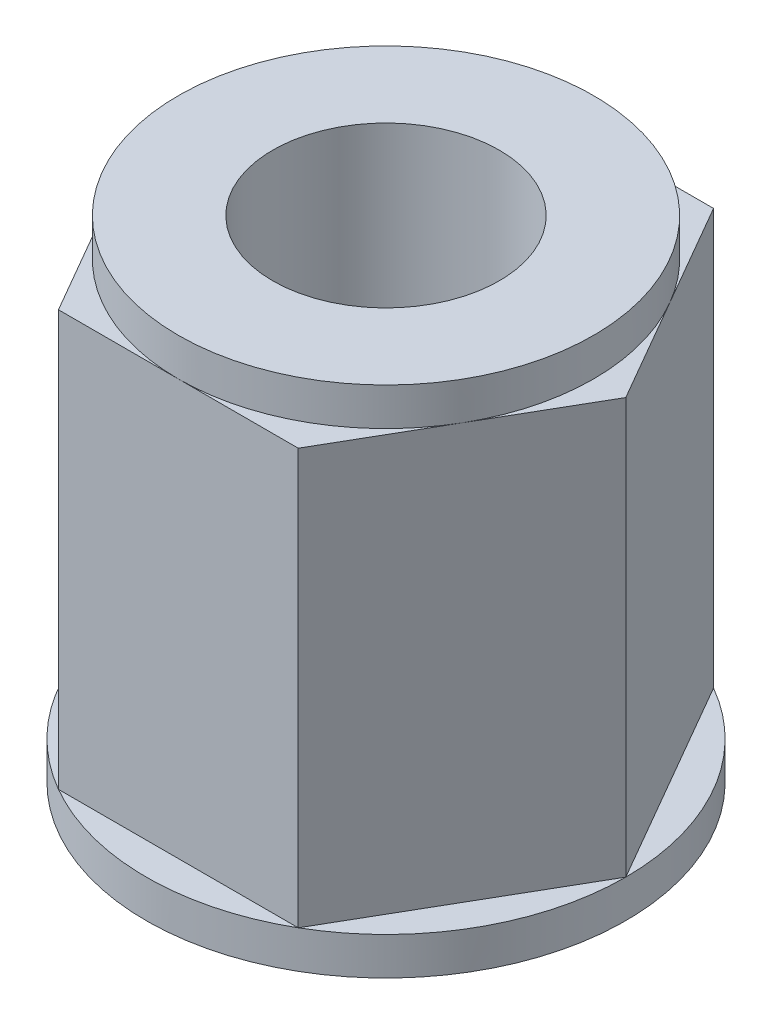
ISO-10303-21;
HEADER;
FILE_DESCRIPTION(('STEP AP214'),'2;1');
FILE_NAME('part.step','',(''),(''),'','','');
FILE_SCHEMA(('AUTOMOTIVE_DESIGN { 1 0 10303 214 1 1 1 1 }'));
ENDSEC;
DATA;
#1=APPLICATION_CONTEXT('core data for automotive mechanical design processes');
#2=APPLICATION_PROTOCOL_DEFINITION('international standard','automotive_design',2000,#1);
#3=PRODUCT_CONTEXT('',#1,'mechanical');
#4=PRODUCT('Part','Part','',(#3));
#5=PRODUCT_RELATED_PRODUCT_CATEGORY('part','',(#4));
#6=PRODUCT_DEFINITION_FORMATION('','',#4);
#7=PRODUCT_DEFINITION_CONTEXT('part definition',#1,'design');
#8=PRODUCT_DEFINITION('design','',#6,#7);
#9=PRODUCT_DEFINITION_SHAPE('','',#8);
#10=(LENGTH_UNIT() NAMED_UNIT(*) SI_UNIT(.MILLI.,.METRE.));
#11=(NAMED_UNIT(*) PLANE_ANGLE_UNIT() SI_UNIT($,.RADIAN.));
#12=(NAMED_UNIT(*) SI_UNIT($,.STERADIAN.) SOLID_ANGLE_UNIT());
#13=UNCERTAINTY_MEASURE_WITH_UNIT(LENGTH_MEASURE(1.E-05),#10,'distance_accuracy_value','');
#14=(GEOMETRIC_REPRESENTATION_CONTEXT(3) GLOBAL_UNCERTAINTY_ASSIGNED_CONTEXT((#13)) GLOBAL_UNIT_ASSIGNED_CONTEXT((#10,
#11,#12)) REPRESENTATION_CONTEXT('',''));
#15=CARTESIAN_POINT('',(0.,0.,0.));
#16=DIRECTION('',(0.,0.,1.));
#17=DIRECTION('',(1.,0.,0.));
#18=AXIS2_PLACEMENT_3D('',#15,#16,#17);
#19=CARTESIAN_POINT('',(0.,11.,0.));
#20=DIRECTION('',(0.,1.,0.));
#21=DIRECTION('',(0.,0.,1.));
#22=AXIS2_PLACEMENT_3D('',#19,#20,#21);
#23=PLANE('',#22);
#24=CARTESIAN_POINT('',(0.,11.,0.));
#25=DIRECTION('',(0.,1.,0.));
#26=DIRECTION('',(0.,0.,1.));
#27=AXIS2_PLACEMENT_3D('',#24,#25,#26);
#28=CIRCLE('',#27,5.49926131403119);
#29=CARTESIAN_POINT('',(0.,11.,5.49926131403119));
#30=VERTEX_POINT('',#29);
#31=CARTESIAN_POINT('',(4.7625,11.,2.74963065701559));
#32=VERTEX_POINT('',#31);
#33=EDGE_CURVE('E43',#30,#32,#28,.T.);
#34=ORIENTED_EDGE('',*,*,#33,.F.);
#35=DIRECTION('',(1.,0.,0.));
#36=VECTOR('',#35,1.);
#37=CARTESIAN_POINT('',(-3.175,11.,5.49926131403119));
#38=LINE('',#37,#36);
#39=CARTESIAN_POINT('',(3.175,11.,5.49926131403119));
#40=VERTEX_POINT('',#39);
#41=EDGE_CURVE('E115',#30,#40,#38,.T.);
#42=ORIENTED_EDGE('',*,*,#41,.T.);
#43=DIRECTION('',(0.5,0.,-0.866025403784439));
#44=VECTOR('',#43,1.);
#45=CARTESIAN_POINT('',(3.175,11.,5.49926131403119));
#46=LINE('',#45,#44);
#47=EDGE_CURVE('E128',#40,#32,#46,.T.);
#48=ORIENTED_EDGE('',*,*,#47,.T.);
#49=EDGE_LOOP('',(#34,#42,#48));
#50=FACE_BOUND('',#49,.T.);
#51=ADVANCED_FACE('F32',(#50),#23,.T.);
#52=CARTESIAN_POINT('',(4.7625,11.,-2.74963065701559));
#53=VERTEX_POINT('',#52);
#54=EDGE_CURVE('E11',#32,#53,#28,.T.);
#55=ORIENTED_EDGE('',*,*,#54,.F.);
#56=CARTESIAN_POINT('',(6.35,11.,0.));
#57=VERTEX_POINT('',#56);
#58=EDGE_CURVE('E114',#32,#57,#46,.T.);
#59=ORIENTED_EDGE('',*,*,#58,.T.);
#60=DIRECTION('',(-0.5,0.,-0.866025403784439));
#61=VECTOR('',#60,1.);
#62=CARTESIAN_POINT('',(6.35,11.,0.));
#63=LINE('',#62,#61);
#64=EDGE_CURVE('E157',#57,#53,#63,.T.);
#65=ORIENTED_EDGE('',*,*,#64,.T.);
#66=EDGE_LOOP('',(#55,#59,#65));
#67=FACE_BOUND('',#66,.T.);
#68=ADVANCED_FACE('F211',(#67),#23,.T.);
#69=CARTESIAN_POINT('',(0.,11.,-5.49926131403118));
#70=VERTEX_POINT('',#69);
#71=EDGE_CURVE('E41',#53,#70,#28,.T.);
#72=ORIENTED_EDGE('',*,*,#71,.F.);
#73=CARTESIAN_POINT('',(3.175,11.,-5.49926131403118));
#74=VERTEX_POINT('',#73);
#75=EDGE_CURVE('E180',#53,#74,#63,.T.);
#76=ORIENTED_EDGE('',*,*,#75,.T.);
#77=DIRECTION('',(-1.,0.,0.));
#78=VECTOR('',#77,1.);
#79=CARTESIAN_POINT('',(3.175,11.,-5.49926131403118));
#80=LINE('',#79,#78);
#81=EDGE_CURVE('E171',#74,#70,#80,.T.);
#82=ORIENTED_EDGE('',*,*,#81,.T.);
#83=EDGE_LOOP('',(#72,#76,#82));
#84=FACE_BOUND('',#83,.T.);
#85=ADVANCED_FACE('F204',(#84),#23,.T.);
#86=CARTESIAN_POINT('',(-4.7625,11.,-2.74963065701559));
#87=VERTEX_POINT('',#86);
#88=EDGE_CURVE('E137',#70,#87,#28,.T.);
#89=ORIENTED_EDGE('',*,*,#88,.F.);
#90=CARTESIAN_POINT('',(-3.175,11.,-5.49926131403118));
#91=VERTEX_POINT('',#90);
#92=EDGE_CURVE('E147',#70,#91,#80,.T.);
#93=ORIENTED_EDGE('',*,*,#92,.T.);
#94=DIRECTION('',(-0.5,0.,0.866025403784439));
#95=VECTOR('',#94,1.);
#96=CARTESIAN_POINT('',(-3.175,11.,-5.49926131403118));
#97=LINE('',#96,#95);
#98=EDGE_CURVE('E174',#91,#87,#97,.T.);
#99=ORIENTED_EDGE('',*,*,#98,.T.);
#100=EDGE_LOOP('',(#89,#93,#99));
#101=FACE_BOUND('',#100,.T.);
#102=ADVANCED_FACE('F201',(#101),#23,.T.);
#103=CARTESIAN_POINT('',(-4.7625,11.,2.74963065701559));
#104=VERTEX_POINT('',#103);
#105=EDGE_CURVE('E135',#87,#104,#28,.T.);
#106=ORIENTED_EDGE('',*,*,#105,.F.);
#107=CARTESIAN_POINT('',(-6.35,11.,0.));
#108=VERTEX_POINT('',#107);
#109=EDGE_CURVE('E173',#87,#108,#97,.T.);
#110=ORIENTED_EDGE('',*,*,#109,.T.);
#111=DIRECTION('',(0.5,0.,0.866025403784439));
#112=VECTOR('',#111,1.);
#113=CARTESIAN_POINT('',(-6.35,11.,0.));
#114=LINE('',#113,#112);
#115=EDGE_CURVE('E126',#108,#104,#114,.T.);
#116=ORIENTED_EDGE('',*,*,#115,.T.);
#117=EDGE_LOOP('',(#106,#110,#116));
#118=FACE_BOUND('',#117,.T.);
#119=ADVANCED_FACE('F203',(#118),#23,.T.);
#120=CARTESIAN_POINT('',(3.175,0.,-5.49926131403118));
#121=DIRECTION('',(0.,0.,-1.));
#122=DIRECTION('',(-1.,0.,0.));
#123=AXIS2_PLACEMENT_3D('',#120,#121,#122);
#124=PLANE('',#123);
#125=ORIENTED_EDGE('',*,*,#81,.F.);
#126=DIRECTION('',(0.,1.,0.));
#127=VECTOR('',#126,1.);
#128=CARTESIAN_POINT('',(3.175,0.,-5.49926131403118));
#129=LINE('',#128,#127);
#130=CARTESIAN_POINT('',(3.175,0.,-5.49926131403118));
#131=VERTEX_POINT('',#130);
#132=EDGE_CURVE('E136',#131,#74,#129,.T.);
#133=ORIENTED_EDGE('',*,*,#132,.F.);
#134=DIRECTION('',(-1.,0.,0.));
#135=VECTOR('',#134,1.);
#136=CARTESIAN_POINT('',(3.175,0.,-5.49926131403118));
#137=LINE('',#136,#135);
#138=CARTESIAN_POINT('',(-3.175,0.,-5.49926131403118));
#139=VERTEX_POINT('',#138);
#140=EDGE_CURVE('E153',#131,#139,#137,.T.);
#141=ORIENTED_EDGE('',*,*,#140,.T.);
#142=DIRECTION('',(0.,1.,0.));
#143=VECTOR('',#142,1.);
#144=CARTESIAN_POINT('',(-3.175,0.,-5.49926131403118));
#145=LINE('',#144,#143);
#146=EDGE_CURVE('E36',#139,#91,#145,.T.);
#147=ORIENTED_EDGE('',*,*,#146,.T.);
#148=ORIENTED_EDGE('',*,*,#92,.F.);
#149=EDGE_LOOP('',(#125,#133,#141,#147,#148));
#150=FACE_BOUND('',#149,.T.);
#151=ADVANCED_FACE('F34',(#150),#124,.T.);
#152=CARTESIAN_POINT('',(6.35,0.,0.));
#153=DIRECTION('',(0.866025403784439,0.,-0.5));
#154=DIRECTION('',(-0.5,0.,-0.866025403784439));
#155=AXIS2_PLACEMENT_3D('',#152,#153,#154);
#156=PLANE('',#155);
#157=ORIENTED_EDGE('',*,*,#64,.F.);
#158=DIRECTION('',(0.,1.,0.));
#159=VECTOR('',#158,1.);
#160=CARTESIAN_POINT('',(6.35,0.,0.));
#161=LINE('',#160,#159);
#162=CARTESIAN_POINT('',(6.35,0.,0.));
#163=VERTEX_POINT('',#162);
#164=EDGE_CURVE('E139',#163,#57,#161,.T.);
#165=ORIENTED_EDGE('',*,*,#164,.F.);
#166=DIRECTION('',(-0.5,0.,-0.866025403784439));
#167=VECTOR('',#166,1.);
#168=CARTESIAN_POINT('',(6.35,0.,0.));
#169=LINE('',#168,#167);
#170=EDGE_CURVE('E168',#163,#131,#169,.T.);
#171=ORIENTED_EDGE('',*,*,#170,.T.);
#172=ORIENTED_EDGE('',*,*,#132,.T.);
#173=ORIENTED_EDGE('',*,*,#75,.F.);
#174=EDGE_LOOP('',(#157,#165,#171,#172,#173));
#175=FACE_BOUND('',#174,.T.);
#176=ADVANCED_FACE('F239',(#175),#156,.T.);
#177=CARTESIAN_POINT('',(3.175,0.,5.49926131403119));
#178=DIRECTION('',(0.866025403784439,0.,0.5));
#179=DIRECTION('',(0.5,0.,-0.866025403784439));
#180=AXIS2_PLACEMENT_3D('',#177,#178,#179);
#181=PLANE('',#180);
#182=ORIENTED_EDGE('',*,*,#47,.F.);
#183=DIRECTION('',(0.,1.,0.));
#184=VECTOR('',#183,1.);
#185=CARTESIAN_POINT('',(3.175,0.,5.49926131403119));
#186=LINE('',#185,#184);
#187=CARTESIAN_POINT('',(3.175,0.,5.49926131403119));
#188=VERTEX_POINT('',#187);
#189=EDGE_CURVE('E122',#188,#40,#186,.T.);
#190=ORIENTED_EDGE('',*,*,#189,.F.);
#191=DIRECTION('',(0.5,0.,-0.866025403784439));
#192=VECTOR('',#191,1.);
#193=CARTESIAN_POINT('',(3.175,0.,5.49926131403119));
#194=LINE('',#193,#192);
#195=EDGE_CURVE('E165',#188,#163,#194,.T.);
#196=ORIENTED_EDGE('',*,*,#195,.T.);
#197=ORIENTED_EDGE('',*,*,#164,.T.);
#198=ORIENTED_EDGE('',*,*,#58,.F.);
#199=EDGE_LOOP('',(#182,#190,#196,#197,#198));
#200=FACE_BOUND('',#199,.T.);
#201=ADVANCED_FACE('F237',(#200),#181,.T.);
#202=CARTESIAN_POINT('',(-3.175,0.,5.49926131403119));
#203=DIRECTION('',(0.,0.,1.));
#204=DIRECTION('',(1.,0.,0.));
#205=AXIS2_PLACEMENT_3D('',#202,#203,#204);
#206=PLANE('',#205);
#207=CARTESIAN_POINT('',(-3.175,11.,5.49926131403119));
#208=VERTEX_POINT('',#207);
#209=EDGE_CURVE('E104',#208,#30,#38,.T.);
#210=ORIENTED_EDGE('',*,*,#209,.F.);
#211=DIRECTION('',(0.,1.,0.));
#212=VECTOR('',#211,1.);
#213=CARTESIAN_POINT('',(-3.175,0.,5.49926131403119));
#214=LINE('',#213,#212);
#215=CARTESIAN_POINT('',(-3.175,0.,5.49926131403119));
#216=VERTEX_POINT('',#215);
#217=EDGE_CURVE('E185',#216,#208,#214,.T.);
#218=ORIENTED_EDGE('',*,*,#217,.F.);
#219=DIRECTION('',(1.,0.,0.));
#220=VECTOR('',#219,1.);
#221=CARTESIAN_POINT('',(-3.175,0.,5.49926131403119));
#222=LINE('',#221,#220);
#223=EDGE_CURVE('E163',#216,#188,#222,.T.);
#224=ORIENTED_EDGE('',*,*,#223,.T.);
#225=ORIENTED_EDGE('',*,*,#189,.T.);
#226=ORIENTED_EDGE('',*,*,#41,.F.);
#227=EDGE_LOOP('',(#210,#218,#224,#225,#226));
#228=FACE_BOUND('',#227,.T.);
#229=ADVANCED_FACE('F119',(#228),#206,.T.);
#230=CARTESIAN_POINT('',(-6.35,0.,0.));
#231=DIRECTION('',(-0.866025403784439,0.,0.5));
#232=DIRECTION('',(0.5,0.,0.866025403784439));
#233=AXIS2_PLACEMENT_3D('',#230,#231,#232);
#234=PLANE('',#233);
#235=ORIENTED_EDGE('',*,*,#115,.F.);
#236=DIRECTION('',(0.,1.,0.));
#237=VECTOR('',#236,1.);
#238=CARTESIAN_POINT('',(-6.35,0.,0.));
#239=LINE('',#238,#237);
#240=CARTESIAN_POINT('',(-6.35,0.,0.));
#241=VERTEX_POINT('',#240);
#242=EDGE_CURVE('E186',#241,#108,#239,.T.);
#243=ORIENTED_EDGE('',*,*,#242,.F.);
#244=DIRECTION('',(0.5,0.,0.866025403784439));
#245=VECTOR('',#244,1.);
#246=CARTESIAN_POINT('',(-6.35,0.,0.));
#247=LINE('',#246,#245);
#248=EDGE_CURVE('E160',#241,#216,#247,.T.);
#249=ORIENTED_EDGE('',*,*,#248,.T.);
#250=ORIENTED_EDGE('',*,*,#217,.T.);
#251=EDGE_CURVE('E110',#104,#208,#114,.T.);
#252=ORIENTED_EDGE('',*,*,#251,.F.);
#253=EDGE_LOOP('',(#235,#243,#249,#250,#252));
#254=FACE_BOUND('',#253,.T.);
#255=ADVANCED_FACE('F228',(#254),#234,.T.);
#256=CARTESIAN_POINT('',(-3.175,0.,-5.49926131403118));
#257=DIRECTION('',(-0.866025403784439,0.,-0.5));
#258=DIRECTION('',(-0.5,0.,0.866025403784439));
#259=AXIS2_PLACEMENT_3D('',#256,#257,#258);
#260=PLANE('',#259);
#261=ORIENTED_EDGE('',*,*,#98,.F.);
#262=ORIENTED_EDGE('',*,*,#146,.F.);
#263=DIRECTION('',(-0.5,0.,0.866025403784439));
#264=VECTOR('',#263,1.);
#265=CARTESIAN_POINT('',(-3.175,0.,-5.49926131403118));
#266=LINE('',#265,#264);
#267=EDGE_CURVE('E156',#139,#241,#266,.T.);
#268=ORIENTED_EDGE('',*,*,#267,.T.);
#269=ORIENTED_EDGE('',*,*,#242,.T.);
#270=ORIENTED_EDGE('',*,*,#109,.F.);
#271=EDGE_LOOP('',(#261,#262,#268,#269,#270));
#272=FACE_BOUND('',#271,.T.);
#273=ADVANCED_FACE('F199',(#272),#260,.T.);
#274=EDGE_CURVE('E108',#104,#30,#28,.T.);
#275=ORIENTED_EDGE('',*,*,#274,.F.);
#276=ORIENTED_EDGE('',*,*,#251,.T.);
#277=ORIENTED_EDGE('',*,*,#209,.T.);
#278=EDGE_LOOP('',(#275,#276,#277));
#279=FACE_BOUND('',#278,.T.);
#280=ADVANCED_FACE('F106',(#279),#23,.T.);
#281=CARTESIAN_POINT('',(0.,0.,0.));
#282=DIRECTION('',(0.,-1.,0.));
#283=DIRECTION('',(0.,0.,-1.));
#284=AXIS2_PLACEMENT_3D('',#281,#282,#283);
#285=PLANE('',#284);
#286=ORIENTED_EDGE('',*,*,#140,.F.);
#287=CARTESIAN_POINT('',(0.,0.,0.));
#288=DIRECTION('',(0.,-1.,0.));
#289=DIRECTION('',(0.,0.,-1.));
#290=AXIS2_PLACEMENT_3D('',#287,#288,#289);
#291=CIRCLE('',#290,6.35);
#292=EDGE_CURVE('E152',#139,#131,#291,.T.);
#293=ORIENTED_EDGE('',*,*,#292,.F.);
#294=EDGE_LOOP('',(#286,#293));
#295=FACE_BOUND('',#294,.T.);
#296=ADVANCED_FACE('F219',(#295),#285,.F.);
#297=ORIENTED_EDGE('',*,*,#170,.F.);
#298=EDGE_CURVE('E148',#131,#163,#291,.T.);
#299=ORIENTED_EDGE('',*,*,#298,.F.);
#300=EDGE_LOOP('',(#297,#299));
#301=FACE_BOUND('',#300,.T.);
#302=ADVANCED_FACE('F224',(#301),#285,.F.);
#303=ORIENTED_EDGE('',*,*,#195,.F.);
#304=EDGE_CURVE('E151',#163,#188,#291,.T.);
#305=ORIENTED_EDGE('',*,*,#304,.F.);
#306=EDGE_LOOP('',(#303,#305));
#307=FACE_BOUND('',#306,.T.);
#308=ADVANCED_FACE('F251',(#307),#285,.F.);
#309=ORIENTED_EDGE('',*,*,#223,.F.);
#310=EDGE_CURVE('E255',#188,#216,#291,.T.);
#311=ORIENTED_EDGE('',*,*,#310,.F.);
#312=EDGE_LOOP('',(#309,#311));
#313=FACE_BOUND('',#312,.T.);
#314=ADVANCED_FACE('F256',(#313),#285,.F.);
#315=ORIENTED_EDGE('',*,*,#248,.F.);
#316=EDGE_CURVE('E259',#216,#241,#291,.T.);
#317=ORIENTED_EDGE('',*,*,#316,.F.);
#318=EDGE_LOOP('',(#315,#317));
#319=FACE_BOUND('',#318,.T.);
#320=ADVANCED_FACE('F274',(#319),#285,.F.);
#321=CARTESIAN_POINT('',(0.,-1.,0.));
#322=DIRECTION('',(0.,1.,0.));
#323=DIRECTION('',(0.,0.,1.));
#324=AXIS2_PLACEMENT_3D('',#321,#322,#323);
#325=CYLINDRICAL_SURFACE('',#324,6.35);
#326=CARTESIAN_POINT('',(0.,-1.,0.));
#327=DIRECTION('',(0.,-1.,0.));
#328=DIRECTION('',(0.,0.,-1.));
#329=AXIS2_PLACEMENT_3D('',#326,#327,#328);
#330=CIRCLE('',#329,6.35);
#331=CARTESIAN_POINT('',(0.,-1.,-6.35));
#332=VERTEX_POINT('',#331);
#333=EDGE_CURVE('E144',#332,#332,#330,.T.);
#334=ORIENTED_EDGE('',*,*,#333,.F.);
#335=EDGE_LOOP('',(#334));
#336=FACE_BOUND('',#335,.T.);
#337=ORIENTED_EDGE('',*,*,#298,.T.);
#338=ORIENTED_EDGE('',*,*,#304,.T.);
#339=ORIENTED_EDGE('',*,*,#310,.T.);
#340=ORIENTED_EDGE('',*,*,#316,.T.);
#341=EDGE_CURVE('E291',#241,#139,#291,.T.);
#342=ORIENTED_EDGE('',*,*,#341,.T.);
#343=ORIENTED_EDGE('',*,*,#292,.T.);
#344=EDGE_LOOP('',(#337,#338,#339,#340,#342,#343));
#345=FACE_BOUND('',#344,.T.);
#346=ADVANCED_FACE('F260',(#336,#345),#325,.T.);
#347=CARTESIAN_POINT('',(0.,-1.,0.));
#348=DIRECTION('',(0.,-1.,0.));
#349=DIRECTION('',(0.,0.,-1.));
#350=AXIS2_PLACEMENT_3D('',#347,#348,#349);
#351=PLANE('',#350);
#352=CARTESIAN_POINT('',(0.,-1.,0.));
#353=DIRECTION('',(0.,-1.,0.));
#354=DIRECTION('',(0.,0.,-1.));
#355=AXIS2_PLACEMENT_3D('',#352,#353,#354);
#356=CIRCLE('',#355,2.99999999999999);
#357=CARTESIAN_POINT('',(0.,-1.,-2.99999999999999));
#358=VERTEX_POINT('',#357);
#359=EDGE_CURVE('E314',#358,#358,#356,.T.);
#360=ORIENTED_EDGE('',*,*,#359,.F.);
#361=EDGE_LOOP('',(#360));
#362=FACE_BOUND('',#361,.T.);
#363=ORIENTED_EDGE('',*,*,#333,.T.);
#364=EDGE_LOOP('',(#363));
#365=FACE_BOUND('',#364,.T.);
#366=ADVANCED_FACE('F272',(#362,#365),#351,.T.);
#367=ORIENTED_EDGE('',*,*,#267,.F.);
#368=ORIENTED_EDGE('',*,*,#341,.F.);
#369=EDGE_LOOP('',(#367,#368));
#370=FACE_BOUND('',#369,.T.);
#371=ADVANCED_FACE('F227',(#370),#285,.F.);
#372=CARTESIAN_POINT('',(0.,12.,0.));
#373=DIRECTION('',(0.,-1.,0.));
#374=DIRECTION('',(0.,0.,-1.));
#375=AXIS2_PLACEMENT_3D('',#372,#373,#374);
#376=CYLINDRICAL_SURFACE('',#375,5.49926131403119);
#377=CARTESIAN_POINT('',(0.,12.,0.));
#378=DIRECTION('',(0.,1.,0.));
#379=DIRECTION('',(0.,0.,1.));
#380=AXIS2_PLACEMENT_3D('',#377,#378,#379);
#381=CIRCLE('',#380,5.49926131403119);
#382=CARTESIAN_POINT('',(0.,12.,5.49926131403119));
#383=VERTEX_POINT('',#382);
#384=EDGE_CURVE('E130',#383,#383,#381,.T.);
#385=ORIENTED_EDGE('',*,*,#384,.F.);
#386=EDGE_LOOP('',(#385));
#387=FACE_BOUND('',#386,.T.);
#388=ORIENTED_EDGE('',*,*,#33,.T.);
#389=ORIENTED_EDGE('',*,*,#54,.T.);
#390=ORIENTED_EDGE('',*,*,#71,.T.);
#391=ORIENTED_EDGE('',*,*,#88,.T.);
#392=ORIENTED_EDGE('',*,*,#105,.T.);
#393=ORIENTED_EDGE('',*,*,#274,.T.);
#394=EDGE_LOOP('',(#388,#389,#390,#391,#392,#393));
#395=FACE_BOUND('',#394,.T.);
#396=ADVANCED_FACE('F133',(#387,#395),#376,.T.);
#397=CARTESIAN_POINT('',(0.,12.,0.));
#398=DIRECTION('',(0.,1.,0.));
#399=DIRECTION('',(0.,0.,1.));
#400=AXIS2_PLACEMENT_3D('',#397,#398,#399);
#401=PLANE('',#400);
#402=CARTESIAN_POINT('',(0.,12.,0.));
#403=DIRECTION('',(0.,-1.,0.));
#404=DIRECTION('',(0.,0.,-1.));
#405=AXIS2_PLACEMENT_3D('',#402,#403,#404);
#406=CIRCLE('',#405,2.99999999999999);
#407=CARTESIAN_POINT('',(0.,12.,-2.99999999999999));
#408=VERTEX_POINT('',#407);
#409=EDGE_CURVE('E131',#408,#408,#406,.T.);
#410=ORIENTED_EDGE('',*,*,#409,.T.);
#411=EDGE_LOOP('',(#410));
#412=FACE_BOUND('',#411,.T.);
#413=ORIENTED_EDGE('',*,*,#384,.T.);
#414=EDGE_LOOP('',(#413));
#415=FACE_BOUND('',#414,.T.);
#416=ADVANCED_FACE('F295',(#412,#415),#401,.T.);
#417=CARTESIAN_POINT('',(0.,-1.,0.));
#418=DIRECTION('',(0.,-1.,0.));
#419=DIRECTION('',(0.,0.,-1.));
#420=AXIS2_PLACEMENT_3D('',#417,#418,#419);
#421=CYLINDRICAL_SURFACE('',#420,2.99999999999999);
#422=ORIENTED_EDGE('',*,*,#409,.F.);
#423=EDGE_LOOP('',(#422));
#424=FACE_BOUND('',#423,.T.);
#425=ORIENTED_EDGE('',*,*,#359,.T.);
#426=EDGE_LOOP('',(#425));
#427=FACE_BOUND('',#426,.T.);
#428=ADVANCED_FACE('F301',(#424,#427),#421,.F.);
#429=CLOSED_SHELL('',(#51,#68,#85,#102,#119,#151,#176,#201,#229,#255,#273,#280,#296,#302,#308,
#314,#320,#346,#366,#371,#396,#416,#428));
#430=MANIFOLD_SOLID_BREP('B2',#429);
#431=ADVANCED_BREP_SHAPE_REPRESENTATION('',(#18,#430),#14);
#432=SHAPE_DEFINITION_REPRESENTATION(#9,#431);
ENDSEC;
END-ISO-10303-21;
